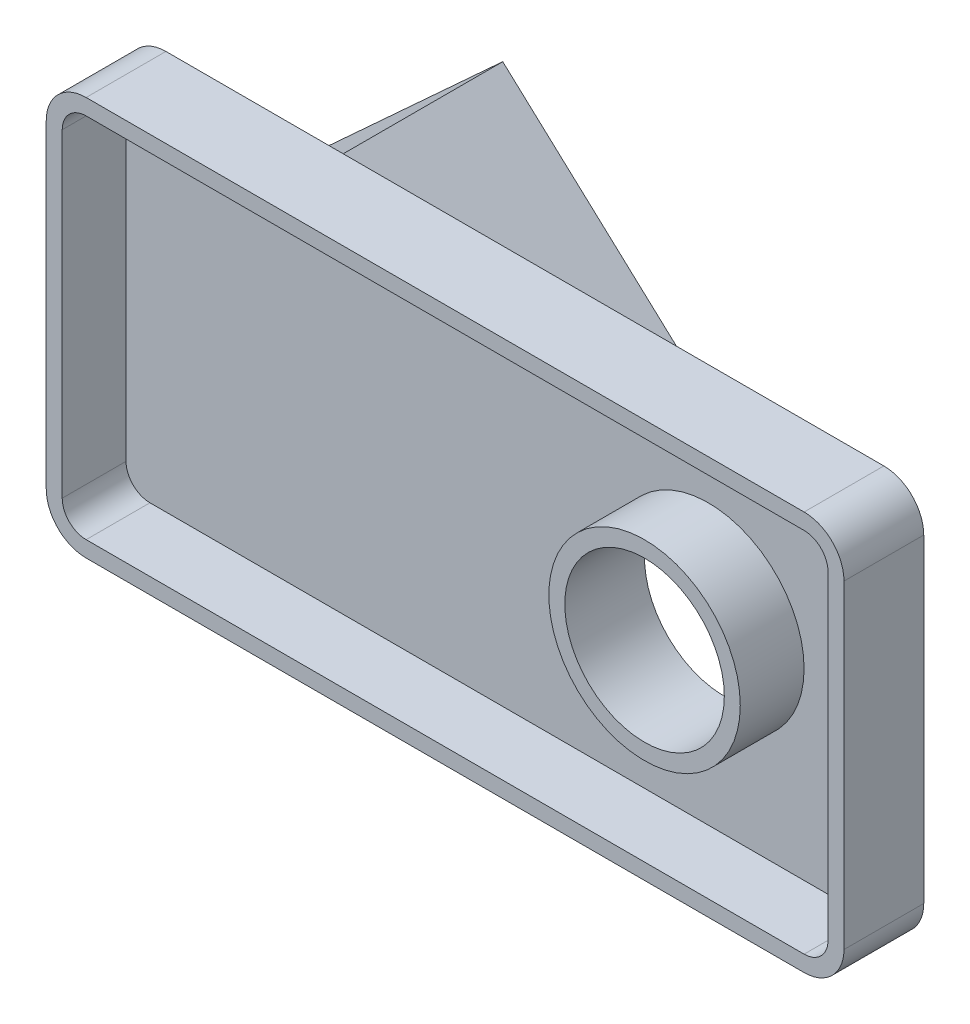
ISO-10303-21;
HEADER;
FILE_DESCRIPTION(('STEP AP214'),'2;1');
FILE_NAME('part.step','',(''),(''),'','','');
FILE_SCHEMA(('AUTOMOTIVE_DESIGN { 1 0 10303 214 1 1 1 1 }'));
ENDSEC;
DATA;
#1=APPLICATION_CONTEXT('core data for automotive mechanical design processes');
#2=APPLICATION_PROTOCOL_DEFINITION('international standard','automotive_design',2000,#1);
#3=PRODUCT_CONTEXT('',#1,'mechanical');
#4=PRODUCT('Part','Part','',(#3));
#5=PRODUCT_RELATED_PRODUCT_CATEGORY('part','',(#4));
#6=PRODUCT_DEFINITION_FORMATION('','',#4);
#7=PRODUCT_DEFINITION_CONTEXT('part definition',#1,'design');
#8=PRODUCT_DEFINITION('design','',#6,#7);
#9=PRODUCT_DEFINITION_SHAPE('','',#8);
#10=(LENGTH_UNIT() NAMED_UNIT(*) SI_UNIT(.MILLI.,.METRE.));
#11=(NAMED_UNIT(*) PLANE_ANGLE_UNIT() SI_UNIT($,.RADIAN.));
#12=(NAMED_UNIT(*) SI_UNIT($,.STERADIAN.) SOLID_ANGLE_UNIT());
#13=UNCERTAINTY_MEASURE_WITH_UNIT(LENGTH_MEASURE(1.E-05),#10,'distance_accuracy_value','');
#14=(GEOMETRIC_REPRESENTATION_CONTEXT(3) GLOBAL_UNCERTAINTY_ASSIGNED_CONTEXT((#13)) GLOBAL_UNIT_ASSIGNED_CONTEXT((#10,
#11,#12)) REPRESENTATION_CONTEXT('',''));
#15=CARTESIAN_POINT('',(0.,0.,0.));
#16=DIRECTION('',(0.,0.,1.));
#17=DIRECTION('',(1.,0.,0.));
#18=AXIS2_PLACEMENT_3D('',#15,#16,#17);
#19=CARTESIAN_POINT('',(0.,0.,0.));
#20=DIRECTION('',(0.,0.,1.));
#21=DIRECTION('',(1.,0.,0.));
#22=AXIS2_PLACEMENT_3D('',#19,#20,#21);
#23=PLANE('',#22);
#24=CARTESIAN_POINT('',(50.,0.,0.));
#25=DIRECTION('',(0.,0.,1.));
#26=DIRECTION('',(1.,0.,0.));
#27=AXIS2_PLACEMENT_3D('',#24,#25,#26);
#28=CIRCLE('',#27,20.);
#29=CARTESIAN_POINT('',(70.,0.,0.));
#30=VERTEX_POINT('',#29);
#31=EDGE_CURVE('E227',#30,#30,#28,.T.);
#32=ORIENTED_EDGE('',*,*,#31,.T.);
#33=EDGE_LOOP('',(#32));
#34=FACE_BOUND('',#33,.T.);
#35=DIRECTION('',(0.736564271276763,-0.676367558564521,0.));
#36=VECTOR('',#35,1.);
#37=CARTESIAN_POINT('',(8.90000000000001,0.,0.));
#38=LINE('',#37,#36);
#39=CARTESIAN_POINT('',(-45.55,50.,0.));
#40=VERTEX_POINT('',#39);
#41=CARTESIAN_POINT('',(8.90000000000001,0.,0.));
#42=VERTEX_POINT('',#41);
#43=EDGE_CURVE('E53',#40,#42,#38,.T.);
#44=ORIENTED_EDGE('',*,*,#43,.F.);
#45=DIRECTION('',(-1.,0.,0.));
#46=VECTOR('',#45,1.);
#47=CARTESIAN_POINT('',(100.,50.,0.));
#48=LINE('',#47,#46);
#49=CARTESIAN_POINT('',(90.,50.,0.));
#50=VERTEX_POINT('',#49);
#51=EDGE_CURVE('E274',#50,#40,#48,.T.);
#52=ORIENTED_EDGE('',*,*,#51,.F.);
#53=CARTESIAN_POINT('',(90.,40.,0.));
#54=DIRECTION('',(0.,0.,1.));
#55=DIRECTION('',(1.,0.,0.));
#56=AXIS2_PLACEMENT_3D('',#53,#54,#55);
#57=CIRCLE('',#56,10.);
#58=CARTESIAN_POINT('',(100.,40.,0.));
#59=VERTEX_POINT('',#58);
#60=EDGE_CURVE('E306',#50,#59,#57,.F.);
#61=ORIENTED_EDGE('',*,*,#60,.T.);
#62=DIRECTION('',(0.,1.,0.));
#63=VECTOR('',#62,1.);
#64=CARTESIAN_POINT('',(100.,-50.,0.));
#65=LINE('',#64,#63);
#66=CARTESIAN_POINT('',(100.,-40.,0.));
#67=VERTEX_POINT('',#66);
#68=EDGE_CURVE('E290',#67,#59,#65,.T.);
#69=ORIENTED_EDGE('',*,*,#68,.F.);
#70=CARTESIAN_POINT('',(90.,-40.,0.));
#71=DIRECTION('',(0.,0.,1.));
#72=DIRECTION('',(1.,0.,0.));
#73=AXIS2_PLACEMENT_3D('',#70,#71,#72);
#74=CIRCLE('',#73,10.);
#75=CARTESIAN_POINT('',(90.,-50.,0.));
#76=VERTEX_POINT('',#75);
#77=EDGE_CURVE('E308',#67,#76,#74,.F.);
#78=ORIENTED_EDGE('',*,*,#77,.T.);
#79=DIRECTION('',(1.,0.,0.));
#80=VECTOR('',#79,1.);
#81=CARTESIAN_POINT('',(100.,-50.,0.));
#82=LINE('',#81,#80);
#83=CARTESIAN_POINT('',(-45.55,-50.,0.));
#84=VERTEX_POINT('',#83);
#85=EDGE_CURVE('E287',#84,#76,#82,.T.);
#86=ORIENTED_EDGE('',*,*,#85,.F.);
#87=DIRECTION('',(-0.736564271276763,-0.676367558564521,0.));
#88=VECTOR('',#87,1.);
#89=CARTESIAN_POINT('',(-45.55,-50.,0.));
#90=LINE('',#89,#88);
#91=EDGE_CURVE('E48',#42,#84,#90,.T.);
#92=ORIENTED_EDGE('',*,*,#91,.F.);
#93=EDGE_LOOP('',(#44,#52,#61,#69,#78,#86,#92));
#94=FACE_BOUND('',#93,.T.);
#95=ADVANCED_FACE('F33',(#34,#94),#23,.F.);
#96=DIRECTION('',(0.736564271276763,0.676367558564521,0.));
#97=VECTOR('',#96,1.);
#98=CARTESIAN_POINT('',(-100.,0.,0.));
#99=LINE('',#98,#97);
#100=CARTESIAN_POINT('',(-100.,0.,0.));
#101=VERTEX_POINT('',#100);
#102=EDGE_CURVE('E189',#101,#40,#99,.T.);
#103=ORIENTED_EDGE('',*,*,#102,.F.);
#104=DIRECTION('',(0.,-1.,0.));
#105=VECTOR('',#104,1.);
#106=CARTESIAN_POINT('',(-100.,-50.,0.));
#107=LINE('',#106,#105);
#108=CARTESIAN_POINT('',(-100.,40.,0.));
#109=VERTEX_POINT('',#108);
#110=EDGE_CURVE('E284',#109,#101,#107,.T.);
#111=ORIENTED_EDGE('',*,*,#110,.F.);
#112=CARTESIAN_POINT('',(-90.,40.,0.));
#113=DIRECTION('',(0.,0.,1.));
#114=DIRECTION('',(1.,0.,0.));
#115=AXIS2_PLACEMENT_3D('',#112,#113,#114);
#116=CIRCLE('',#115,10.);
#117=CARTESIAN_POINT('',(-90.,50.,0.));
#118=VERTEX_POINT('',#117);
#119=EDGE_CURVE('E303',#109,#118,#116,.F.);
#120=ORIENTED_EDGE('',*,*,#119,.T.);
#121=EDGE_CURVE('E293',#40,#118,#48,.T.);
#122=ORIENTED_EDGE('',*,*,#121,.F.);
#123=EDGE_LOOP('',(#103,#111,#120,#122));
#124=FACE_BOUND('',#123,.T.);
#125=ADVANCED_FACE('F366',(#124),#23,.F.);
#126=DIRECTION('',(-0.736564271276763,0.676367558564521,0.));
#127=VECTOR('',#126,1.);
#128=CARTESIAN_POINT('',(-45.55,-50.,0.));
#129=LINE('',#128,#127);
#130=EDGE_CURVE('E348',#84,#101,#129,.T.);
#131=ORIENTED_EDGE('',*,*,#130,.F.);
#132=CARTESIAN_POINT('',(-90.,-50.,0.));
#133=VERTEX_POINT('',#132);
#134=EDGE_CURVE('E288',#133,#84,#82,.T.);
#135=ORIENTED_EDGE('',*,*,#134,.F.);
#136=CARTESIAN_POINT('',(-90.,-40.,0.));
#137=DIRECTION('',(0.,0.,1.));
#138=DIRECTION('',(1.,0.,0.));
#139=AXIS2_PLACEMENT_3D('',#136,#137,#138);
#140=CIRCLE('',#139,10.);
#141=CARTESIAN_POINT('',(-100.,-40.,0.));
#142=VERTEX_POINT('',#141);
#143=EDGE_CURVE('E300',#133,#142,#140,.F.);
#144=ORIENTED_EDGE('',*,*,#143,.T.);
#145=EDGE_CURVE('E267',#101,#142,#107,.T.);
#146=ORIENTED_EDGE('',*,*,#145,.F.);
#147=EDGE_LOOP('',(#131,#135,#144,#146));
#148=FACE_BOUND('',#147,.T.);
#149=ADVANCED_FACE('F346',(#148),#23,.F.);
#150=CARTESIAN_POINT('',(0.,0.,20.));
#151=DIRECTION('',(0.,0.,1.));
#152=DIRECTION('',(1.,0.,0.));
#153=AXIS2_PLACEMENT_3D('',#150,#151,#152);
#154=PLANE('',#153);
#155=CARTESIAN_POINT('',(50.,0.,20.));
#156=DIRECTION('',(0.,0.,1.));
#157=DIRECTION('',(1.,0.,0.));
#158=AXIS2_PLACEMENT_3D('',#155,#156,#157);
#159=CIRCLE('',#158,20.);
#160=CARTESIAN_POINT('',(70.,0.,20.));
#161=VERTEX_POINT('',#160);
#162=EDGE_CURVE('E264',#161,#161,#159,.T.);
#163=ORIENTED_EDGE('',*,*,#162,.F.);
#164=EDGE_LOOP('',(#163));
#165=FACE_BOUND('',#164,.T.);
#166=CARTESIAN_POINT('',(50.,0.,20.));
#167=DIRECTION('',(0.,0.,1.));
#168=DIRECTION('',(1.,0.,0.));
#169=AXIS2_PLACEMENT_3D('',#166,#167,#168);
#170=CIRCLE('',#169,24.);
#171=CARTESIAN_POINT('',(74.,0.,20.));
#172=VERTEX_POINT('',#171);
#173=EDGE_CURVE('E195',#172,#172,#170,.T.);
#174=ORIENTED_EDGE('',*,*,#173,.T.);
#175=EDGE_LOOP('',(#174));
#176=FACE_BOUND('',#175,.T.);
#177=ADVANCED_FACE('F400',(#165,#176),#154,.T.);
#178=DIRECTION('',(1.,0.,0.));
#179=VECTOR('',#178,1.);
#180=CARTESIAN_POINT('',(100.,-46.,20.));
#181=LINE('',#180,#179);
#182=CARTESIAN_POINT('',(-90.,-46.,20.));
#183=VERTEX_POINT('',#182);
#184=CARTESIAN_POINT('',(90.,-46.,20.));
#185=VERTEX_POINT('',#184);
#186=EDGE_CURVE('E248',#183,#185,#181,.T.);
#187=ORIENTED_EDGE('',*,*,#186,.F.);
#188=CARTESIAN_POINT('',(-90.,-40.,20.));
#189=DIRECTION('',(0.,0.,1.));
#190=DIRECTION('',(1.,0.,0.));
#191=AXIS2_PLACEMENT_3D('',#188,#189,#190);
#192=CIRCLE('',#191,6.);
#193=CARTESIAN_POINT('',(-96.,-40.,20.));
#194=VERTEX_POINT('',#193);
#195=EDGE_CURVE('E244',#194,#183,#192,.T.);
#196=ORIENTED_EDGE('',*,*,#195,.F.);
#197=DIRECTION('',(0.,-1.,0.));
#198=VECTOR('',#197,1.);
#199=CARTESIAN_POINT('',(-96.,-50.,20.));
#200=LINE('',#199,#198);
#201=CARTESIAN_POINT('',(-96.,40.,20.));
#202=VERTEX_POINT('',#201);
#203=EDGE_CURVE('E222',#202,#194,#200,.T.);
#204=ORIENTED_EDGE('',*,*,#203,.F.);
#205=CARTESIAN_POINT('',(-90.,40.,20.));
#206=DIRECTION('',(0.,0.,1.));
#207=DIRECTION('',(1.,0.,0.));
#208=AXIS2_PLACEMENT_3D('',#205,#206,#207);
#209=CIRCLE('',#208,6.);
#210=CARTESIAN_POINT('',(-90.,46.,20.));
#211=VERTEX_POINT('',#210);
#212=EDGE_CURVE('E250',#211,#202,#209,.T.);
#213=ORIENTED_EDGE('',*,*,#212,.F.);
#214=DIRECTION('',(-1.,0.,0.));
#215=VECTOR('',#214,1.);
#216=CARTESIAN_POINT('',(100.,46.,20.));
#217=LINE('',#216,#215);
#218=CARTESIAN_POINT('',(90.,46.,20.));
#219=VERTEX_POINT('',#218);
#220=EDGE_CURVE('E239',#219,#211,#217,.T.);
#221=ORIENTED_EDGE('',*,*,#220,.F.);
#222=CARTESIAN_POINT('',(90.,40.,20.));
#223=DIRECTION('',(0.,0.,1.));
#224=DIRECTION('',(1.,0.,0.));
#225=AXIS2_PLACEMENT_3D('',#222,#223,#224);
#226=CIRCLE('',#225,6.);
#227=CARTESIAN_POINT('',(96.,40.,20.));
#228=VERTEX_POINT('',#227);
#229=EDGE_CURVE('E255',#228,#219,#226,.T.);
#230=ORIENTED_EDGE('',*,*,#229,.F.);
#231=DIRECTION('',(0.,1.,0.));
#232=VECTOR('',#231,1.);
#233=CARTESIAN_POINT('',(96.,-50.,20.));
#234=LINE('',#233,#232);
#235=CARTESIAN_POINT('',(96.,-40.,20.));
#236=VERTEX_POINT('',#235);
#237=EDGE_CURVE('E253',#236,#228,#234,.T.);
#238=ORIENTED_EDGE('',*,*,#237,.F.);
#239=CARTESIAN_POINT('',(90.,-40.,20.));
#240=DIRECTION('',(0.,0.,1.));
#241=DIRECTION('',(1.,0.,0.));
#242=AXIS2_PLACEMENT_3D('',#239,#240,#241);
#243=CIRCLE('',#242,6.);
#244=EDGE_CURVE('E234',#185,#236,#243,.T.);
#245=ORIENTED_EDGE('',*,*,#244,.F.);
#246=EDGE_LOOP('',(#187,#196,#204,#213,#221,#230,#238,#245));
#247=FACE_BOUND('',#246,.T.);
#248=DIRECTION('',(1.,0.,0.));
#249=VECTOR('',#248,1.);
#250=CARTESIAN_POINT('',(100.,-50.,20.));
#251=LINE('',#250,#249);
#252=CARTESIAN_POINT('',(-90.,-50.,20.));
#253=VERTEX_POINT('',#252);
#254=CARTESIAN_POINT('',(90.,-50.,20.));
#255=VERTEX_POINT('',#254);
#256=EDGE_CURVE('E273',#253,#255,#251,.T.);
#257=ORIENTED_EDGE('',*,*,#256,.T.);
#258=CARTESIAN_POINT('',(90.,-40.,20.));
#259=DIRECTION('',(0.,0.,1.));
#260=DIRECTION('',(1.,0.,0.));
#261=AXIS2_PLACEMENT_3D('',#258,#259,#260);
#262=CIRCLE('',#261,10.);
#263=CARTESIAN_POINT('',(100.,-40.,20.));
#264=VERTEX_POINT('',#263);
#265=EDGE_CURVE('E322',#255,#264,#262,.T.);
#266=ORIENTED_EDGE('',*,*,#265,.T.);
#267=DIRECTION('',(0.,1.,0.));
#268=VECTOR('',#267,1.);
#269=CARTESIAN_POINT('',(100.,-50.,20.));
#270=LINE('',#269,#268);
#271=CARTESIAN_POINT('',(100.,40.,20.));
#272=VERTEX_POINT('',#271);
#273=EDGE_CURVE('E277',#264,#272,#270,.T.);
#274=ORIENTED_EDGE('',*,*,#273,.T.);
#275=CARTESIAN_POINT('',(90.,40.,20.));
#276=DIRECTION('',(0.,0.,1.));
#277=DIRECTION('',(1.,0.,0.));
#278=AXIS2_PLACEMENT_3D('',#275,#276,#277);
#279=CIRCLE('',#278,10.);
#280=CARTESIAN_POINT('',(90.,50.,20.));
#281=VERTEX_POINT('',#280);
#282=EDGE_CURVE('E320',#272,#281,#279,.T.);
#283=ORIENTED_EDGE('',*,*,#282,.T.);
#284=DIRECTION('',(-1.,0.,0.));
#285=VECTOR('',#284,1.);
#286=CARTESIAN_POINT('',(100.,50.,20.));
#287=LINE('',#286,#285);
#288=CARTESIAN_POINT('',(-90.,50.,20.));
#289=VERTEX_POINT('',#288);
#290=EDGE_CURVE('E280',#281,#289,#287,.T.);
#291=ORIENTED_EDGE('',*,*,#290,.T.);
#292=CARTESIAN_POINT('',(-90.,40.,20.));
#293=DIRECTION('',(0.,0.,1.));
#294=DIRECTION('',(1.,0.,0.));
#295=AXIS2_PLACEMENT_3D('',#292,#293,#294);
#296=CIRCLE('',#295,10.);
#297=CARTESIAN_POINT('',(-100.,40.,20.));
#298=VERTEX_POINT('',#297);
#299=EDGE_CURVE('E318',#289,#298,#296,.T.);
#300=ORIENTED_EDGE('',*,*,#299,.T.);
#301=DIRECTION('',(0.,-1.,0.));
#302=VECTOR('',#301,1.);
#303=CARTESIAN_POINT('',(-100.,-50.,20.));
#304=LINE('',#303,#302);
#305=CARTESIAN_POINT('',(-100.,-40.,20.));
#306=VERTEX_POINT('',#305);
#307=EDGE_CURVE('E270',#298,#306,#304,.T.);
#308=ORIENTED_EDGE('',*,*,#307,.T.);
#309=CARTESIAN_POINT('',(-90.,-40.,20.));
#310=DIRECTION('',(0.,0.,1.));
#311=DIRECTION('',(1.,0.,0.));
#312=AXIS2_PLACEMENT_3D('',#309,#310,#311);
#313=CIRCLE('',#312,10.);
#314=EDGE_CURVE('E316',#306,#253,#313,.T.);
#315=ORIENTED_EDGE('',*,*,#314,.T.);
#316=EDGE_LOOP('',(#257,#266,#274,#283,#291,#300,#308,#315));
#317=FACE_BOUND('',#316,.T.);
#318=ADVANCED_FACE('F337',(#247,#317),#154,.T.);
#319=CARTESIAN_POINT('',(-100.,-50.,20.));
#320=DIRECTION('',(1.,0.,0.));
#321=DIRECTION('',(0.,0.,-1.));
#322=AXIS2_PLACEMENT_3D('',#319,#320,#321);
#323=PLANE('',#322);
#324=ORIENTED_EDGE('',*,*,#307,.F.);
#325=DIRECTION('',(0.,0.,-1.));
#326=VECTOR('',#325,1.);
#327=CARTESIAN_POINT('',(-100.,40.,20.));
#328=LINE('',#327,#326);
#329=EDGE_CURVE('E11',#298,#109,#328,.T.);
#330=ORIENTED_EDGE('',*,*,#329,.T.);
#331=ORIENTED_EDGE('',*,*,#110,.T.);
#332=ORIENTED_EDGE('',*,*,#145,.T.);
#333=DIRECTION('',(0.,0.,-1.));
#334=VECTOR('',#333,1.);
#335=CARTESIAN_POINT('',(-100.,-40.,20.));
#336=LINE('',#335,#334);
#337=EDGE_CURVE('E41',#142,#306,#336,.F.);
#338=ORIENTED_EDGE('',*,*,#337,.T.);
#339=EDGE_LOOP('',(#324,#330,#331,#332,#338));
#340=FACE_BOUND('',#339,.T.);
#341=ADVANCED_FACE('F331',(#340),#323,.F.);
#342=CARTESIAN_POINT('',(100.,-50.,20.));
#343=DIRECTION('',(0.,1.,0.));
#344=DIRECTION('',(-1.,0.,0.));
#345=AXIS2_PLACEMENT_3D('',#342,#343,#344);
#346=PLANE('',#345);
#347=ORIENTED_EDGE('',*,*,#134,.T.);
#348=ORIENTED_EDGE('',*,*,#85,.T.);
#349=DIRECTION('',(0.,0.,-1.));
#350=VECTOR('',#349,1.);
#351=CARTESIAN_POINT('',(90.,-50.,20.));
#352=LINE('',#351,#350);
#353=EDGE_CURVE('E314',#76,#255,#352,.F.);
#354=ORIENTED_EDGE('',*,*,#353,.T.);
#355=ORIENTED_EDGE('',*,*,#256,.F.);
#356=DIRECTION('',(0.,0.,-1.));
#357=VECTOR('',#356,1.);
#358=CARTESIAN_POINT('',(-90.,-50.,20.));
#359=LINE('',#358,#357);
#360=EDGE_CURVE('E311',#253,#133,#359,.T.);
#361=ORIENTED_EDGE('',*,*,#360,.T.);
#362=EDGE_LOOP('',(#347,#348,#354,#355,#361));
#363=FACE_BOUND('',#362,.T.);
#364=ADVANCED_FACE('F343',(#363),#346,.F.);
#365=CARTESIAN_POINT('',(100.,-50.,20.));
#366=DIRECTION('',(-1.,0.,0.));
#367=DIRECTION('',(0.,0.,1.));
#368=AXIS2_PLACEMENT_3D('',#365,#366,#367);
#369=PLANE('',#368);
#370=ORIENTED_EDGE('',*,*,#273,.F.);
#371=DIRECTION('',(0.,0.,-1.));
#372=VECTOR('',#371,1.);
#373=CARTESIAN_POINT('',(100.,-40.,20.));
#374=LINE('',#373,#372);
#375=EDGE_CURVE('E297',#264,#67,#374,.T.);
#376=ORIENTED_EDGE('',*,*,#375,.T.);
#377=ORIENTED_EDGE('',*,*,#68,.T.);
#378=DIRECTION('',(0.,0.,-1.));
#379=VECTOR('',#378,1.);
#380=CARTESIAN_POINT('',(100.,40.,20.));
#381=LINE('',#380,#379);
#382=EDGE_CURVE('E283',#59,#272,#381,.F.);
#383=ORIENTED_EDGE('',*,*,#382,.T.);
#384=EDGE_LOOP('',(#370,#376,#377,#383));
#385=FACE_BOUND('',#384,.T.);
#386=ADVANCED_FACE('F377',(#385),#369,.F.);
#387=CARTESIAN_POINT('',(100.,50.,20.));
#388=DIRECTION('',(0.,-1.,0.));
#389=DIRECTION('',(1.,0.,0.));
#390=AXIS2_PLACEMENT_3D('',#387,#388,#389);
#391=PLANE('',#390);
#392=ORIENTED_EDGE('',*,*,#290,.F.);
#393=DIRECTION('',(0.,0.,-1.));
#394=VECTOR('',#393,1.);
#395=CARTESIAN_POINT('',(90.,50.,20.));
#396=LINE('',#395,#394);
#397=EDGE_CURVE('E326',#281,#50,#396,.T.);
#398=ORIENTED_EDGE('',*,*,#397,.T.);
#399=ORIENTED_EDGE('',*,*,#51,.T.);
#400=ORIENTED_EDGE('',*,*,#121,.T.);
#401=DIRECTION('',(0.,0.,-1.));
#402=VECTOR('',#401,1.);
#403=CARTESIAN_POINT('',(-90.,50.,20.));
#404=LINE('',#403,#402);
#405=EDGE_CURVE('E324',#118,#289,#404,.F.);
#406=ORIENTED_EDGE('',*,*,#405,.T.);
#407=EDGE_LOOP('',(#392,#398,#399,#400,#406));
#408=FACE_BOUND('',#407,.T.);
#409=ADVANCED_FACE('F370',(#408),#391,.F.);
#410=CARTESIAN_POINT('',(50.,0.,20.));
#411=DIRECTION('',(0.,0.,-1.));
#412=DIRECTION('',(-1.,0.,0.));
#413=AXIS2_PLACEMENT_3D('',#410,#411,#412);
#414=CYLINDRICAL_SURFACE('',#413,20.);
#415=ORIENTED_EDGE('',*,*,#162,.T.);
#416=EDGE_LOOP('',(#415));
#417=FACE_BOUND('',#416,.T.);
#418=ORIENTED_EDGE('',*,*,#31,.F.);
#419=EDGE_LOOP('',(#418));
#420=FACE_BOUND('',#419,.T.);
#421=ADVANCED_FACE('F412',(#417,#420),#414,.F.);
#422=CARTESIAN_POINT('',(90.,-40.,20.));
#423=DIRECTION('',(0.,0.,-1.));
#424=DIRECTION('',(-1.,0.,0.));
#425=AXIS2_PLACEMENT_3D('',#422,#423,#424);
#426=CYLINDRICAL_SURFACE('',#425,10.);
#427=ORIENTED_EDGE('',*,*,#265,.F.);
#428=ORIENTED_EDGE('',*,*,#353,.F.);
#429=ORIENTED_EDGE('',*,*,#77,.F.);
#430=ORIENTED_EDGE('',*,*,#375,.F.);
#431=EDGE_LOOP('',(#427,#428,#429,#430));
#432=FACE_BOUND('',#431,.T.);
#433=ADVANCED_FACE('F389',(#432),#426,.T.);
#434=CARTESIAN_POINT('',(90.,40.,20.));
#435=DIRECTION('',(0.,0.,-1.));
#436=DIRECTION('',(-1.,0.,0.));
#437=AXIS2_PLACEMENT_3D('',#434,#435,#436);
#438=CYLINDRICAL_SURFACE('',#437,10.);
#439=ORIENTED_EDGE('',*,*,#282,.F.);
#440=ORIENTED_EDGE('',*,*,#382,.F.);
#441=ORIENTED_EDGE('',*,*,#60,.F.);
#442=ORIENTED_EDGE('',*,*,#397,.F.);
#443=EDGE_LOOP('',(#439,#440,#441,#442));
#444=FACE_BOUND('',#443,.T.);
#445=ADVANCED_FACE('F380',(#444),#438,.T.);
#446=CARTESIAN_POINT('',(-90.,40.,20.));
#447=DIRECTION('',(0.,0.,-1.));
#448=DIRECTION('',(-1.,0.,0.));
#449=AXIS2_PLACEMENT_3D('',#446,#447,#448);
#450=CYLINDRICAL_SURFACE('',#449,10.);
#451=ORIENTED_EDGE('',*,*,#299,.F.);
#452=ORIENTED_EDGE('',*,*,#405,.F.);
#453=ORIENTED_EDGE('',*,*,#119,.F.);
#454=ORIENTED_EDGE('',*,*,#329,.F.);
#455=EDGE_LOOP('',(#451,#452,#453,#454));
#456=FACE_BOUND('',#455,.T.);
#457=ADVANCED_FACE('F382',(#456),#450,.T.);
#458=CARTESIAN_POINT('',(-90.,-40.,20.));
#459=DIRECTION('',(0.,0.,-1.));
#460=DIRECTION('',(-1.,0.,0.));
#461=AXIS2_PLACEMENT_3D('',#458,#459,#460);
#462=CYLINDRICAL_SURFACE('',#461,10.);
#463=ORIENTED_EDGE('',*,*,#314,.F.);
#464=ORIENTED_EDGE('',*,*,#337,.F.);
#465=ORIENTED_EDGE('',*,*,#143,.F.);
#466=ORIENTED_EDGE('',*,*,#360,.F.);
#467=EDGE_LOOP('',(#463,#464,#465,#466));
#468=FACE_BOUND('',#467,.T.);
#469=ADVANCED_FACE('F35',(#468),#462,.T.);
#470=CARTESIAN_POINT('',(0.,0.,4.));
#471=DIRECTION('',(0.,0.,1.));
#472=DIRECTION('',(1.,0.,0.));
#473=AXIS2_PLACEMENT_3D('',#470,#471,#472);
#474=PLANE('',#473);
#475=DIRECTION('',(0.,1.,0.));
#476=VECTOR('',#475,1.);
#477=CARTESIAN_POINT('',(96.,-50.,4.));
#478=LINE('',#477,#476);
#479=CARTESIAN_POINT('',(96.,-40.,4.));
#480=VERTEX_POINT('',#479);
#481=CARTESIAN_POINT('',(96.,40.,4.));
#482=VERTEX_POINT('',#481);
#483=EDGE_CURVE('E201',#480,#482,#478,.T.);
#484=ORIENTED_EDGE('',*,*,#483,.T.);
#485=CARTESIAN_POINT('',(90.,40.,4.));
#486=DIRECTION('',(0.,0.,1.));
#487=DIRECTION('',(1.,0.,0.));
#488=AXIS2_PLACEMENT_3D('',#485,#486,#487);
#489=CIRCLE('',#488,6.);
#490=CARTESIAN_POINT('',(90.,46.,4.));
#491=VERTEX_POINT('',#490);
#492=EDGE_CURVE('E209',#491,#482,#489,.F.);
#493=ORIENTED_EDGE('',*,*,#492,.F.);
#494=DIRECTION('',(-1.,0.,0.));
#495=VECTOR('',#494,1.);
#496=CARTESIAN_POINT('',(100.,46.,4.));
#497=LINE('',#496,#495);
#498=CARTESIAN_POINT('',(-90.,46.,4.));
#499=VERTEX_POINT('',#498);
#500=EDGE_CURVE('E204',#491,#499,#497,.T.);
#501=ORIENTED_EDGE('',*,*,#500,.T.);
#502=CARTESIAN_POINT('',(-90.,40.,4.));
#503=DIRECTION('',(0.,0.,1.));
#504=DIRECTION('',(1.,0.,0.));
#505=AXIS2_PLACEMENT_3D('',#502,#503,#504);
#506=CIRCLE('',#505,6.);
#507=CARTESIAN_POINT('',(-96.,40.,4.));
#508=VERTEX_POINT('',#507);
#509=EDGE_CURVE('E215',#508,#499,#506,.F.);
#510=ORIENTED_EDGE('',*,*,#509,.F.);
#511=DIRECTION('',(0.,-1.,0.));
#512=VECTOR('',#511,1.);
#513=CARTESIAN_POINT('',(-96.,-50.,4.));
#514=LINE('',#513,#512);
#515=CARTESIAN_POINT('',(-96.,-40.,4.));
#516=VERTEX_POINT('',#515);
#517=EDGE_CURVE('E212',#508,#516,#514,.T.);
#518=ORIENTED_EDGE('',*,*,#517,.T.);
#519=CARTESIAN_POINT('',(-90.,-40.,4.));
#520=DIRECTION('',(0.,0.,1.));
#521=DIRECTION('',(1.,0.,0.));
#522=AXIS2_PLACEMENT_3D('',#519,#520,#521);
#523=CIRCLE('',#522,6.);
#524=CARTESIAN_POINT('',(-90.,-46.,4.));
#525=VERTEX_POINT('',#524);
#526=EDGE_CURVE('E213',#525,#516,#523,.F.);
#527=ORIENTED_EDGE('',*,*,#526,.F.);
#528=DIRECTION('',(1.,0.,0.));
#529=VECTOR('',#528,1.);
#530=CARTESIAN_POINT('',(100.,-46.,4.));
#531=LINE('',#530,#529);
#532=CARTESIAN_POINT('',(90.,-46.,4.));
#533=VERTEX_POINT('',#532);
#534=EDGE_CURVE('E205',#525,#533,#531,.T.);
#535=ORIENTED_EDGE('',*,*,#534,.T.);
#536=CARTESIAN_POINT('',(90.,-40.,4.));
#537=DIRECTION('',(0.,0.,1.));
#538=DIRECTION('',(1.,0.,0.));
#539=AXIS2_PLACEMENT_3D('',#536,#537,#538);
#540=CIRCLE('',#539,6.);
#541=EDGE_CURVE('E206',#480,#533,#540,.F.);
#542=ORIENTED_EDGE('',*,*,#541,.F.);
#543=EDGE_LOOP('',(#484,#493,#501,#510,#518,#527,#535,#542));
#544=FACE_BOUND('',#543,.T.);
#545=CARTESIAN_POINT('',(50.,0.,4.));
#546=DIRECTION('',(0.,0.,1.));
#547=DIRECTION('',(1.,0.,0.));
#548=AXIS2_PLACEMENT_3D('',#545,#546,#547);
#549=CIRCLE('',#548,24.);
#550=CARTESIAN_POINT('',(74.,0.,4.));
#551=VERTEX_POINT('',#550);
#552=EDGE_CURVE('E192',#551,#551,#549,.T.);
#553=ORIENTED_EDGE('',*,*,#552,.F.);
#554=EDGE_LOOP('',(#553));
#555=FACE_BOUND('',#554,.T.);
#556=ADVANCED_FACE('F388',(#544,#555),#474,.T.);
#557=CARTESIAN_POINT('',(-96.,-50.,20.));
#558=DIRECTION('',(1.,0.,0.));
#559=DIRECTION('',(0.,0.,-1.));
#560=AXIS2_PLACEMENT_3D('',#557,#558,#559);
#561=PLANE('',#560);
#562=ORIENTED_EDGE('',*,*,#203,.T.);
#563=DIRECTION('',(0.,0.,-1.));
#564=VECTOR('',#563,1.);
#565=CARTESIAN_POINT('',(-96.,-40.,20.));
#566=LINE('',#565,#564);
#567=EDGE_CURVE('E228',#516,#194,#566,.F.);
#568=ORIENTED_EDGE('',*,*,#567,.F.);
#569=ORIENTED_EDGE('',*,*,#517,.F.);
#570=DIRECTION('',(0.,0.,-1.));
#571=VECTOR('',#570,1.);
#572=CARTESIAN_POINT('',(-96.,40.,20.));
#573=LINE('',#572,#571);
#574=EDGE_CURVE('E224',#202,#508,#573,.T.);
#575=ORIENTED_EDGE('',*,*,#574,.F.);
#576=EDGE_LOOP('',(#562,#568,#569,#575));
#577=FACE_BOUND('',#576,.T.);
#578=ADVANCED_FACE('F447',(#577),#561,.T.);
#579=CARTESIAN_POINT('',(100.,-46.,20.));
#580=DIRECTION('',(0.,1.,0.));
#581=DIRECTION('',(-1.,0.,0.));
#582=AXIS2_PLACEMENT_3D('',#579,#580,#581);
#583=PLANE('',#582);
#584=ORIENTED_EDGE('',*,*,#534,.F.);
#585=DIRECTION('',(0.,0.,1.));
#586=VECTOR('',#585,1.);
#587=CARTESIAN_POINT('',(-90.,-46.,20.));
#588=LINE('',#587,#586);
#589=EDGE_CURVE('E208',#183,#525,#588,.F.);
#590=ORIENTED_EDGE('',*,*,#589,.F.);
#591=ORIENTED_EDGE('',*,*,#186,.T.);
#592=DIRECTION('',(0.,0.,1.));
#593=VECTOR('',#592,1.);
#594=CARTESIAN_POINT('',(90.,-46.,20.));
#595=LINE('',#594,#593);
#596=EDGE_CURVE('E242',#533,#185,#595,.T.);
#597=ORIENTED_EDGE('',*,*,#596,.F.);
#598=EDGE_LOOP('',(#584,#590,#591,#597));
#599=FACE_BOUND('',#598,.T.);
#600=ADVANCED_FACE('F443',(#599),#583,.T.);
#601=CARTESIAN_POINT('',(96.,-50.,20.));
#602=DIRECTION('',(-1.,0.,0.));
#603=DIRECTION('',(0.,0.,1.));
#604=AXIS2_PLACEMENT_3D('',#601,#602,#603);
#605=PLANE('',#604);
#606=ORIENTED_EDGE('',*,*,#237,.T.);
#607=DIRECTION('',(0.,0.,1.));
#608=VECTOR('',#607,1.);
#609=CARTESIAN_POINT('',(96.,40.,20.));
#610=LINE('',#609,#608);
#611=EDGE_CURVE('E237',#482,#228,#610,.T.);
#612=ORIENTED_EDGE('',*,*,#611,.F.);
#613=ORIENTED_EDGE('',*,*,#483,.F.);
#614=DIRECTION('',(0.,0.,1.));
#615=VECTOR('',#614,1.);
#616=CARTESIAN_POINT('',(96.,-40.,20.));
#617=LINE('',#616,#615);
#618=EDGE_CURVE('E216',#236,#480,#617,.F.);
#619=ORIENTED_EDGE('',*,*,#618,.F.);
#620=EDGE_LOOP('',(#606,#612,#613,#619));
#621=FACE_BOUND('',#620,.T.);
#622=ADVANCED_FACE('F439',(#621),#605,.T.);
#623=CARTESIAN_POINT('',(100.,46.,20.));
#624=DIRECTION('',(0.,-1.,0.));
#625=DIRECTION('',(1.,0.,0.));
#626=AXIS2_PLACEMENT_3D('',#623,#624,#625);
#627=PLANE('',#626);
#628=ORIENTED_EDGE('',*,*,#220,.T.);
#629=DIRECTION('',(0.,0.,1.));
#630=VECTOR('',#629,1.);
#631=CARTESIAN_POINT('',(-90.,46.,20.));
#632=LINE('',#631,#630);
#633=EDGE_CURVE('E232',#499,#211,#632,.T.);
#634=ORIENTED_EDGE('',*,*,#633,.F.);
#635=ORIENTED_EDGE('',*,*,#500,.F.);
#636=DIRECTION('',(0.,0.,1.));
#637=VECTOR('',#636,1.);
#638=CARTESIAN_POINT('',(90.,46.,20.));
#639=LINE('',#638,#637);
#640=EDGE_CURVE('E231',#219,#491,#639,.F.);
#641=ORIENTED_EDGE('',*,*,#640,.F.);
#642=EDGE_LOOP('',(#628,#634,#635,#641));
#643=FACE_BOUND('',#642,.T.);
#644=ADVANCED_FACE('F435',(#643),#627,.T.);
#645=CARTESIAN_POINT('',(50.,0.,20.));
#646=DIRECTION('',(0.,0.,-1.));
#647=DIRECTION('',(-1.,0.,0.));
#648=AXIS2_PLACEMENT_3D('',#645,#646,#647);
#649=CYLINDRICAL_SURFACE('',#648,24.);
#650=ORIENTED_EDGE('',*,*,#173,.F.);
#651=EDGE_LOOP('',(#650));
#652=FACE_BOUND('',#651,.T.);
#653=ORIENTED_EDGE('',*,*,#552,.T.);
#654=EDGE_LOOP('',(#653));
#655=FACE_BOUND('',#654,.T.);
#656=ADVANCED_FACE('F431',(#652,#655),#649,.T.);
#657=CARTESIAN_POINT('',(90.,-40.,20.));
#658=DIRECTION('',(0.,0.,-1.));
#659=DIRECTION('',(-1.,0.,0.));
#660=AXIS2_PLACEMENT_3D('',#657,#658,#659);
#661=CYLINDRICAL_SURFACE('',#660,6.);
#662=ORIENTED_EDGE('',*,*,#244,.T.);
#663=ORIENTED_EDGE('',*,*,#618,.T.);
#664=ORIENTED_EDGE('',*,*,#541,.T.);
#665=ORIENTED_EDGE('',*,*,#596,.T.);
#666=EDGE_LOOP('',(#662,#663,#664,#665));
#667=FACE_BOUND('',#666,.T.);
#668=ADVANCED_FACE('F427',(#667),#661,.F.);
#669=CARTESIAN_POINT('',(90.,40.,20.));
#670=DIRECTION('',(0.,0.,-1.));
#671=DIRECTION('',(-1.,0.,0.));
#672=AXIS2_PLACEMENT_3D('',#669,#670,#671);
#673=CYLINDRICAL_SURFACE('',#672,6.);
#674=ORIENTED_EDGE('',*,*,#229,.T.);
#675=ORIENTED_EDGE('',*,*,#640,.T.);
#676=ORIENTED_EDGE('',*,*,#492,.T.);
#677=ORIENTED_EDGE('',*,*,#611,.T.);
#678=EDGE_LOOP('',(#674,#675,#676,#677));
#679=FACE_BOUND('',#678,.T.);
#680=ADVANCED_FACE('F423',(#679),#673,.F.);
#681=CARTESIAN_POINT('',(-90.,40.,20.));
#682=DIRECTION('',(0.,0.,-1.));
#683=DIRECTION('',(-1.,0.,0.));
#684=AXIS2_PLACEMENT_3D('',#681,#682,#683);
#685=CYLINDRICAL_SURFACE('',#684,6.);
#686=ORIENTED_EDGE('',*,*,#212,.T.);
#687=ORIENTED_EDGE('',*,*,#574,.T.);
#688=ORIENTED_EDGE('',*,*,#509,.T.);
#689=ORIENTED_EDGE('',*,*,#633,.T.);
#690=EDGE_LOOP('',(#686,#687,#688,#689));
#691=FACE_BOUND('',#690,.T.);
#692=ADVANCED_FACE('F419',(#691),#685,.F.);
#693=CARTESIAN_POINT('',(-90.,-40.,20.));
#694=DIRECTION('',(0.,0.,-1.));
#695=DIRECTION('',(-1.,0.,0.));
#696=AXIS2_PLACEMENT_3D('',#693,#694,#695);
#697=CYLINDRICAL_SURFACE('',#696,6.);
#698=ORIENTED_EDGE('',*,*,#195,.T.);
#699=ORIENTED_EDGE('',*,*,#589,.T.);
#700=ORIENTED_EDGE('',*,*,#526,.T.);
#701=ORIENTED_EDGE('',*,*,#567,.T.);
#702=EDGE_LOOP('',(#698,#699,#700,#701));
#703=FACE_BOUND('',#702,.T.);
#704=ADVANCED_FACE('F416',(#703),#697,.F.);
#705=CARTESIAN_POINT('',(8.90000000000001,0.,-40.));
#706=DIRECTION('',(-0.676367558564521,-0.736564271276763,0.));
#707=DIRECTION('',(0.736564271276763,-0.676367558564521,0.));
#708=AXIS2_PLACEMENT_3D('',#705,#706,#707);
#709=PLANE('',#708);
#710=ORIENTED_EDGE('',*,*,#43,.T.);
#711=DIRECTION('',(0.,0.,1.));
#712=VECTOR('',#711,1.);
#713=CARTESIAN_POINT('',(8.90000000000001,0.,-40.));
#714=LINE('',#713,#712);
#715=CARTESIAN_POINT('',(8.90000000000001,0.,-40.));
#716=VERTEX_POINT('',#715);
#717=EDGE_CURVE('E174',#716,#42,#714,.T.);
#718=ORIENTED_EDGE('',*,*,#717,.F.);
#719=DIRECTION('',(0.736564271276763,-0.676367558564521,0.));
#720=VECTOR('',#719,1.);
#721=CARTESIAN_POINT('',(8.90000000000001,0.,-40.));
#722=LINE('',#721,#720);
#723=CARTESIAN_POINT('',(-45.55,50.,-40.));
#724=VERTEX_POINT('',#723);
#725=EDGE_CURVE('E180',#724,#716,#722,.T.);
#726=ORIENTED_EDGE('',*,*,#725,.F.);
#727=DIRECTION('',(0.,0.,1.));
#728=VECTOR('',#727,1.);
#729=CARTESIAN_POINT('',(-45.55,50.,-40.));
#730=LINE('',#729,#728);
#731=EDGE_CURVE('E356',#724,#40,#730,.T.);
#732=ORIENTED_EDGE('',*,*,#731,.T.);
#733=EDGE_LOOP('',(#710,#718,#726,#732));
#734=FACE_BOUND('',#733,.T.);
#735=ADVANCED_FACE('F191',(#734),#709,.F.);
#736=CARTESIAN_POINT('',(-45.55,-50.,-40.));
#737=DIRECTION('',(-0.676367558564521,0.736564271276763,0.));
#738=DIRECTION('',(-0.736564271276763,-0.676367558564521,0.));
#739=AXIS2_PLACEMENT_3D('',#736,#737,#738);
#740=PLANE('',#739);
#741=ORIENTED_EDGE('',*,*,#91,.T.);
#742=DIRECTION('',(0.,0.,1.));
#743=VECTOR('',#742,1.);
#744=CARTESIAN_POINT('',(-45.55,-50.,-40.));
#745=LINE('',#744,#743);
#746=CARTESIAN_POINT('',(-45.55,-50.,-40.));
#747=VERTEX_POINT('',#746);
#748=EDGE_CURVE('E176',#747,#84,#745,.T.);
#749=ORIENTED_EDGE('',*,*,#748,.F.);
#750=DIRECTION('',(-0.736564271276763,-0.676367558564521,0.));
#751=VECTOR('',#750,1.);
#752=CARTESIAN_POINT('',(-45.55,-50.,-40.));
#753=LINE('',#752,#751);
#754=EDGE_CURVE('E170',#716,#747,#753,.T.);
#755=ORIENTED_EDGE('',*,*,#754,.F.);
#756=ORIENTED_EDGE('',*,*,#717,.T.);
#757=EDGE_LOOP('',(#741,#749,#755,#756));
#758=FACE_BOUND('',#757,.T.);
#759=ADVANCED_FACE('F172',(#758),#740,.F.);
#760=CARTESIAN_POINT('',(-45.55,-50.,-40.));
#761=DIRECTION('',(0.676367558564521,0.736564271276763,0.));
#762=DIRECTION('',(-0.736564271276763,0.676367558564521,0.));
#763=AXIS2_PLACEMENT_3D('',#760,#761,#762);
#764=PLANE('',#763);
#765=ORIENTED_EDGE('',*,*,#130,.T.);
#766=DIRECTION('',(0.,0.,1.));
#767=VECTOR('',#766,1.);
#768=CARTESIAN_POINT('',(-100.,0.,-40.));
#769=LINE('',#768,#767);
#770=CARTESIAN_POINT('',(-100.,0.,-40.));
#771=VERTEX_POINT('',#770);
#772=EDGE_CURVE('E197',#771,#101,#769,.T.);
#773=ORIENTED_EDGE('',*,*,#772,.F.);
#774=DIRECTION('',(-0.736564271276763,0.676367558564521,0.));
#775=VECTOR('',#774,1.);
#776=CARTESIAN_POINT('',(-45.55,-50.,-40.));
#777=LINE('',#776,#775);
#778=EDGE_CURVE('E179',#747,#771,#777,.T.);
#779=ORIENTED_EDGE('',*,*,#778,.F.);
#780=ORIENTED_EDGE('',*,*,#748,.T.);
#781=EDGE_LOOP('',(#765,#773,#779,#780));
#782=FACE_BOUND('',#781,.T.);
#783=ADVANCED_FACE('F354',(#782),#764,.F.);
#784=CARTESIAN_POINT('',(-100.,0.,-40.));
#785=DIRECTION('',(0.676367558564521,-0.736564271276763,0.));
#786=DIRECTION('',(0.736564271276763,0.676367558564521,0.));
#787=AXIS2_PLACEMENT_3D('',#784,#785,#786);
#788=PLANE('',#787);
#789=ORIENTED_EDGE('',*,*,#102,.T.);
#790=ORIENTED_EDGE('',*,*,#731,.F.);
#791=DIRECTION('',(0.736564271276763,0.676367558564521,0.));
#792=VECTOR('',#791,1.);
#793=CARTESIAN_POINT('',(-100.,0.,-40.));
#794=LINE('',#793,#792);
#795=EDGE_CURVE('E185',#771,#724,#794,.T.);
#796=ORIENTED_EDGE('',*,*,#795,.F.);
#797=ORIENTED_EDGE('',*,*,#772,.T.);
#798=EDGE_LOOP('',(#789,#790,#796,#797));
#799=FACE_BOUND('',#798,.T.);
#800=ADVANCED_FACE('F363',(#799),#788,.F.);
#801=CARTESIAN_POINT('',(0.,0.,-40.));
#802=DIRECTION('',(0.,0.,-1.));
#803=DIRECTION('',(-1.,0.,0.));
#804=AXIS2_PLACEMENT_3D('',#801,#802,#803);
#805=PLANE('',#804);
#806=ORIENTED_EDGE('',*,*,#725,.T.);
#807=ORIENTED_EDGE('',*,*,#754,.T.);
#808=ORIENTED_EDGE('',*,*,#778,.T.);
#809=ORIENTED_EDGE('',*,*,#795,.T.);
#810=EDGE_LOOP('',(#806,#807,#808,#809));
#811=FACE_BOUND('',#810,.T.);
#812=ADVANCED_FACE('F183',(#811),#805,.T.);
#813=CLOSED_SHELL('',(#95,#125,#149,#177,#318,#341,#364,#386,#409,#421,#433,#445,#457,#469,#556,
#578,#600,#622,#644,#656,#668,#680,#692,#704,#735,#759,#783,#800,#812));
#814=MANIFOLD_SOLID_BREP('B2',#813);
#815=ADVANCED_BREP_SHAPE_REPRESENTATION('',(#18,#814),#14);
#816=SHAPE_DEFINITION_REPRESENTATION(#9,#815);
ENDSEC;
END-ISO-10303-21;
